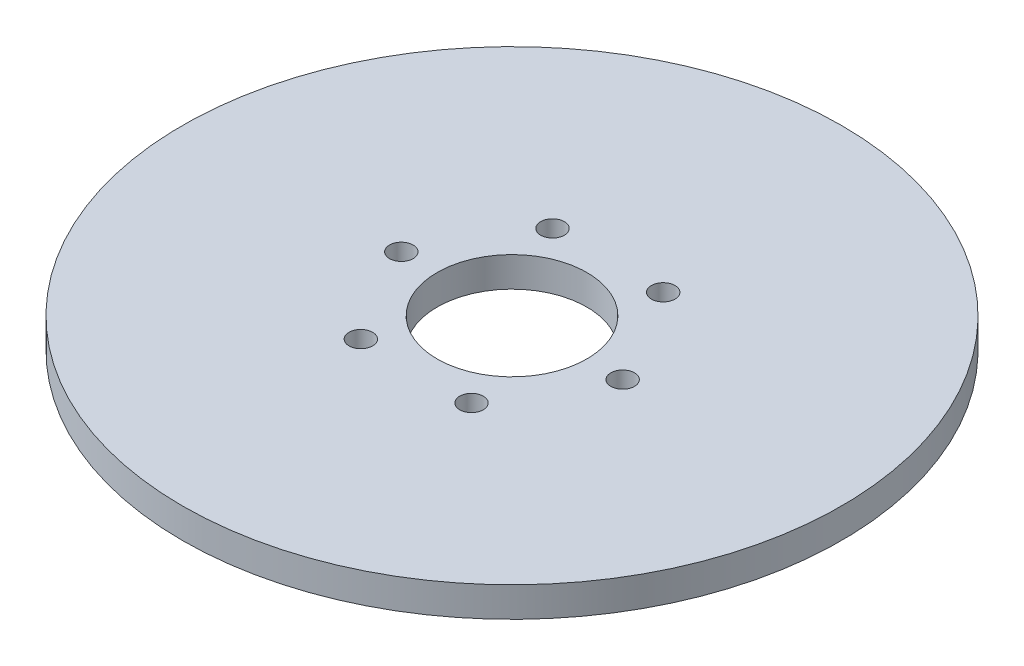
ISO-10303-21;
HEADER;
FILE_DESCRIPTION(('STEP AP214'),'2;1');
FILE_NAME('part.step','',(''),(''),'','','');
FILE_SCHEMA(('AUTOMOTIVE_DESIGN { 1 0 10303 214 1 1 1 1 }'));
ENDSEC;
DATA;
#1=APPLICATION_CONTEXT('core data for automotive mechanical design processes');
#2=APPLICATION_PROTOCOL_DEFINITION('international standard','automotive_design',2000,#1);
#3=PRODUCT_CONTEXT('',#1,'mechanical');
#4=PRODUCT('Part','Part','',(#3));
#5=PRODUCT_RELATED_PRODUCT_CATEGORY('part','',(#4));
#6=PRODUCT_DEFINITION_FORMATION('','',#4);
#7=PRODUCT_DEFINITION_CONTEXT('part definition',#1,'design');
#8=PRODUCT_DEFINITION('design','',#6,#7);
#9=PRODUCT_DEFINITION_SHAPE('','',#8);
#10=(LENGTH_UNIT() NAMED_UNIT(*) SI_UNIT(.MILLI.,.METRE.));
#11=(NAMED_UNIT(*) PLANE_ANGLE_UNIT() SI_UNIT($,.RADIAN.));
#12=(NAMED_UNIT(*) SI_UNIT($,.STERADIAN.) SOLID_ANGLE_UNIT());
#13=UNCERTAINTY_MEASURE_WITH_UNIT(LENGTH_MEASURE(1.E-05),#10,'distance_accuracy_value','');
#14=(GEOMETRIC_REPRESENTATION_CONTEXT(3) GLOBAL_UNCERTAINTY_ASSIGNED_CONTEXT((#13)) GLOBAL_UNIT_ASSIGNED_CONTEXT((#10,
#11,#12)) REPRESENTATION_CONTEXT('',''));
#15=CARTESIAN_POINT('',(0.,0.,0.));
#16=DIRECTION('',(0.,0.,1.));
#17=DIRECTION('',(1.,0.,0.));
#18=AXIS2_PLACEMENT_3D('',#15,#16,#17);
#19=CARTESIAN_POINT('',(0.,5.,0.));
#20=DIRECTION('',(0.,-1.,0.));
#21=DIRECTION('',(0.,0.,-1.));
#22=AXIS2_PLACEMENT_3D('',#19,#20,#21);
#23=CYLINDRICAL_SURFACE('',#22,55.);
#24=CARTESIAN_POINT('',(0.,5.,0.));
#25=DIRECTION('',(0.,1.,0.));
#26=DIRECTION('',(0.,0.,1.));
#27=AXIS2_PLACEMENT_3D('',#24,#25,#26);
#28=CIRCLE('',#27,55.);
#29=CARTESIAN_POINT('',(0.,5.,55.));
#30=VERTEX_POINT('',#29);
#31=EDGE_CURVE('E10',#30,#30,#28,.T.);
#32=ORIENTED_EDGE('',*,*,#31,.F.);
#33=EDGE_LOOP('',(#32));
#34=FACE_BOUND('',#33,.T.);
#35=CARTESIAN_POINT('',(0.,0.,0.));
#36=DIRECTION('',(0.,1.,0.));
#37=DIRECTION('',(0.,0.,1.));
#38=AXIS2_PLACEMENT_3D('',#35,#36,#37);
#39=CIRCLE('',#38,55.);
#40=CARTESIAN_POINT('',(0.,0.,55.));
#41=VERTEX_POINT('',#40);
#42=EDGE_CURVE('E37',#41,#41,#39,.T.);
#43=ORIENTED_EDGE('',*,*,#42,.T.);
#44=EDGE_LOOP('',(#43));
#45=FACE_BOUND('',#44,.T.);
#46=ADVANCED_FACE('F40',(#34,#45),#23,.T.);
#47=CARTESIAN_POINT('',(0.,5.,0.));
#48=DIRECTION('',(0.,1.,0.));
#49=DIRECTION('',(0.,0.,1.));
#50=AXIS2_PLACEMENT_3D('',#47,#48,#49);
#51=PLANE('',#50);
#52=CARTESIAN_POINT('',(-9.23436310623241,5.,-15.9943860755337));
#53=DIRECTION('',(0.,1.,0.));
#54=DIRECTION('',(-0.866025403784433,0.,0.50000000000001));
#55=AXIS2_PLACEMENT_3D('',#52,#53,#54);
#56=CIRCLE('',#55,1.97238586780923);
#57=CARTESIAN_POINT('',(-10.9424993738206,5.,-15.008193141629));
#58=VERTEX_POINT('',#57);
#59=EDGE_CURVE('E70',#58,#58,#56,.T.);
#60=ORIENTED_EDGE('',*,*,#59,.F.);
#61=EDGE_LOOP('',(#60));
#62=FACE_BOUND('',#61,.T.);
#63=CARTESIAN_POINT('',(9.23436310623207,5.,-15.9943860755338));
#64=DIRECTION('',(0.,1.,0.));
#65=DIRECTION('',(-0.866025403784443,0.,-0.499999999999992));
#66=AXIS2_PLACEMENT_3D('',#63,#64,#65);
#67=CIRCLE('',#66,1.97238586780923);
#68=CARTESIAN_POINT('',(7.52622683864386,5.,-16.9805790094384));
#69=VERTEX_POINT('',#68);
#70=EDGE_CURVE('E71',#69,#69,#67,.T.);
#71=ORIENTED_EDGE('',*,*,#70,.F.);
#72=EDGE_LOOP('',(#71));
#73=FACE_BOUND('',#72,.T.);
#74=CARTESIAN_POINT('',(18.4687262124644,5.,0.));
#75=DIRECTION('',(0.,1.,0.));
#76=DIRECTION('',(0.,0.,-1.));
#77=AXIS2_PLACEMENT_3D('',#74,#75,#76);
#78=CIRCLE('',#77,1.97238586780923);
#79=CARTESIAN_POINT('',(18.4687262124644,5.,-1.97238586780923));
#80=VERTEX_POINT('',#79);
#81=EDGE_CURVE('E78',#80,#80,#78,.T.);
#82=ORIENTED_EDGE('',*,*,#81,.F.);
#83=EDGE_LOOP('',(#82));
#84=FACE_BOUND('',#83,.T.);
#85=CARTESIAN_POINT('',(9.2343631062323,5.,15.9943860755337));
#86=DIRECTION('',(0.,1.,0.));
#87=DIRECTION('',(0.866025403784436,0.,-0.500000000000004));
#88=AXIS2_PLACEMENT_3D('',#85,#86,#87);
#89=CIRCLE('',#88,1.97238586780923);
#90=CARTESIAN_POINT('',(10.9424993738205,5.,15.0081931416291));
#91=VERTEX_POINT('',#90);
#92=EDGE_CURVE('E84',#91,#91,#89,.T.);
#93=ORIENTED_EDGE('',*,*,#92,.F.);
#94=EDGE_LOOP('',(#93));
#95=FACE_BOUND('',#94,.T.);
#96=CARTESIAN_POINT('',(-9.23436310623219,5.,15.9943860755338));
#97=DIRECTION('',(0.,1.,0.));
#98=DIRECTION('',(0.86602540378444,0.,0.499999999999998));
#99=AXIS2_PLACEMENT_3D('',#96,#97,#98);
#100=CIRCLE('',#99,1.97238586780923);
#101=CARTESIAN_POINT('',(-7.52622683864398,5.,16.9805790094384));
#102=VERTEX_POINT('',#101);
#103=EDGE_CURVE('E61',#102,#102,#100,.T.);
#104=ORIENTED_EDGE('',*,*,#103,.F.);
#105=EDGE_LOOP('',(#104));
#106=FACE_BOUND('',#105,.T.);
#107=CARTESIAN_POINT('',(-18.4687262124644,5.,0.));
#108=DIRECTION('',(0.,1.,0.));
#109=DIRECTION('',(0.,0.,1.));
#110=AXIS2_PLACEMENT_3D('',#107,#108,#109);
#111=CIRCLE('',#110,1.97238586780923);
#112=CARTESIAN_POINT('',(-18.4687262124644,5.,1.97238586780923));
#113=VERTEX_POINT('',#112);
#114=EDGE_CURVE('E54',#113,#113,#111,.T.);
#115=ORIENTED_EDGE('',*,*,#114,.F.);
#116=EDGE_LOOP('',(#115));
#117=FACE_BOUND('',#116,.T.);
#118=CARTESIAN_POINT('',(0.,5.,0.));
#119=DIRECTION('',(0.,1.,0.));
#120=DIRECTION('',(0.,0.,1.));
#121=AXIS2_PLACEMENT_3D('',#118,#119,#120);
#122=CIRCLE('',#121,12.5);
#123=CARTESIAN_POINT('',(0.,5.,12.5));
#124=VERTEX_POINT('',#123);
#125=EDGE_CURVE('E50',#124,#124,#122,.T.);
#126=ORIENTED_EDGE('',*,*,#125,.F.);
#127=EDGE_LOOP('',(#126));
#128=FACE_BOUND('',#127,.T.);
#129=ORIENTED_EDGE('',*,*,#31,.T.);
#130=EDGE_LOOP('',(#129));
#131=FACE_BOUND('',#130,.T.);
#132=ADVANCED_FACE('F99',(#62,#73,#84,#95,#106,#117,#128,#131),#51,.T.);
#133=CARTESIAN_POINT('',(0.,0.,0.));
#134=DIRECTION('',(0.,1.,0.));
#135=DIRECTION('',(0.,0.,1.));
#136=AXIS2_PLACEMENT_3D('',#133,#134,#135);
#137=PLANE('',#136);
#138=CARTESIAN_POINT('',(0.,0.,0.));
#139=DIRECTION('',(0.,1.,0.));
#140=DIRECTION('',(0.,0.,1.));
#141=AXIS2_PLACEMENT_3D('',#138,#139,#140);
#142=CIRCLE('',#141,12.5);
#143=CARTESIAN_POINT('',(0.,0.,12.5));
#144=VERTEX_POINT('',#143);
#145=EDGE_CURVE('E47',#144,#144,#142,.T.);
#146=ORIENTED_EDGE('',*,*,#145,.T.);
#147=EDGE_LOOP('',(#146));
#148=FACE_BOUND('',#147,.T.);
#149=ORIENTED_EDGE('',*,*,#42,.F.);
#150=EDGE_LOOP('',(#149));
#151=FACE_BOUND('',#150,.T.);
#152=ADVANCED_FACE('F103',(#148,#151),#137,.F.);
#153=CARTESIAN_POINT('',(0.,5.,0.));
#154=DIRECTION('',(0.,-1.,0.));
#155=DIRECTION('',(0.,0.,-1.));
#156=AXIS2_PLACEMENT_3D('',#153,#154,#155);
#157=CYLINDRICAL_SURFACE('',#156,12.5);
#158=ORIENTED_EDGE('',*,*,#125,.T.);
#159=EDGE_LOOP('',(#158));
#160=FACE_BOUND('',#159,.T.);
#161=ORIENTED_EDGE('',*,*,#145,.F.);
#162=EDGE_LOOP('',(#161));
#163=FACE_BOUND('',#162,.T.);
#164=ADVANCED_FACE('F115',(#160,#163),#157,.F.);
#165=CARTESIAN_POINT('',(-18.4687262124644,1.69371454571005,0.));
#166=DIRECTION('',(0.,1.,0.));
#167=DIRECTION('',(0.,0.,1.));
#168=AXIS2_PLACEMENT_3D('',#165,#166,#167);
#169=CYLINDRICAL_SURFACE('',#168,1.97238586780923);
#170=CARTESIAN_POINT('',(-18.4687262124644,1.69371454571005,0.));
#171=DIRECTION('',(0.,1.,0.));
#172=DIRECTION('',(0.,0.,1.));
#173=AXIS2_PLACEMENT_3D('',#170,#171,#172);
#174=CIRCLE('',#173,1.97238586780923);
#175=CARTESIAN_POINT('',(-18.4687262124644,1.69371454571005,1.97238586780923));
#176=VERTEX_POINT('',#175);
#177=EDGE_CURVE('E55',#176,#176,#174,.T.);
#178=ORIENTED_EDGE('',*,*,#177,.F.);
#179=EDGE_LOOP('',(#178));
#180=FACE_BOUND('',#179,.T.);
#181=ORIENTED_EDGE('',*,*,#114,.T.);
#182=EDGE_LOOP('',(#181));
#183=FACE_BOUND('',#182,.T.);
#184=ADVANCED_FACE('F113',(#180,#183),#169,.F.);
#185=CARTESIAN_POINT('',(-18.4687262124644,1.69371454571005,0.));
#186=DIRECTION('',(0.,1.,0.));
#187=DIRECTION('',(0.,0.,1.));
#188=AXIS2_PLACEMENT_3D('',#185,#186,#187);
#189=PLANE('',#188);
#190=ORIENTED_EDGE('',*,*,#177,.T.);
#191=EDGE_LOOP('',(#190));
#192=FACE_BOUND('',#191,.T.);
#193=ADVANCED_FACE('F144',(#192),#189,.T.);
#194=CARTESIAN_POINT('',(-9.23436310623219,1.69371454571005,15.9943860755338));
#195=DIRECTION('',(0.,1.,0.));
#196=DIRECTION('',(0.,0.,1.));
#197=AXIS2_PLACEMENT_3D('',#194,#195,#196);
#198=CYLINDRICAL_SURFACE('',#197,1.97238586780923);
#199=CARTESIAN_POINT('',(-9.23436310623219,1.69371454571005,15.9943860755338));
#200=DIRECTION('',(0.,1.,0.));
#201=DIRECTION('',(0.86602540378444,0.,0.499999999999998));
#202=AXIS2_PLACEMENT_3D('',#199,#200,#201);
#203=CIRCLE('',#202,1.97238586780923);
#204=CARTESIAN_POINT('',(-7.52622683864398,1.69371454571005,16.9805790094384));
#205=VERTEX_POINT('',#204);
#206=EDGE_CURVE('E59',#205,#205,#203,.T.);
#207=ORIENTED_EDGE('',*,*,#206,.F.);
#208=EDGE_LOOP('',(#207));
#209=FACE_BOUND('',#208,.T.);
#210=ORIENTED_EDGE('',*,*,#103,.T.);
#211=EDGE_LOOP('',(#210));
#212=FACE_BOUND('',#211,.T.);
#213=ADVANCED_FACE('F153',(#209,#212),#198,.F.);
#214=CARTESIAN_POINT('',(-9.23436310623219,1.69371454571005,15.9943860755338));
#215=DIRECTION('',(0.,1.,0.));
#216=DIRECTION('',(0.86602540378444,0.,0.499999999999998));
#217=AXIS2_PLACEMENT_3D('',#214,#215,#216);
#218=PLANE('',#217);
#219=ORIENTED_EDGE('',*,*,#206,.T.);
#220=EDGE_LOOP('',(#219));
#221=FACE_BOUND('',#220,.T.);
#222=ADVANCED_FACE('F96',(#221),#218,.T.);
#223=CARTESIAN_POINT('',(9.2343631062323,1.69371454571005,15.9943860755337));
#224=DIRECTION('',(0.,1.,0.));
#225=DIRECTION('',(0.,0.,1.));
#226=AXIS2_PLACEMENT_3D('',#223,#224,#225);
#227=CYLINDRICAL_SURFACE('',#226,1.97238586780923);
#228=CARTESIAN_POINT('',(9.2343631062323,1.69371454571005,15.9943860755337));
#229=DIRECTION('',(0.,1.,0.));
#230=DIRECTION('',(0.866025403784436,0.,-0.500000000000004));
#231=AXIS2_PLACEMENT_3D('',#228,#229,#230);
#232=CIRCLE('',#231,1.97238586780923);
#233=CARTESIAN_POINT('',(10.9424993738205,1.69371454571005,15.0081931416291));
#234=VERTEX_POINT('',#233);
#235=EDGE_CURVE('E63',#234,#234,#232,.T.);
#236=ORIENTED_EDGE('',*,*,#235,.F.);
#237=EDGE_LOOP('',(#236));
#238=FACE_BOUND('',#237,.T.);
#239=ORIENTED_EDGE('',*,*,#92,.T.);
#240=EDGE_LOOP('',(#239));
#241=FACE_BOUND('',#240,.T.);
#242=ADVANCED_FACE('F91',(#238,#241),#227,.F.);
#243=CARTESIAN_POINT('',(9.2343631062323,1.69371454571005,15.9943860755337));
#244=DIRECTION('',(0.,1.,0.));
#245=DIRECTION('',(0.866025403784436,0.,-0.500000000000004));
#246=AXIS2_PLACEMENT_3D('',#243,#244,#245);
#247=PLANE('',#246);
#248=ORIENTED_EDGE('',*,*,#235,.T.);
#249=EDGE_LOOP('',(#248));
#250=FACE_BOUND('',#249,.T.);
#251=ADVANCED_FACE('F93',(#250),#247,.T.);
#252=CARTESIAN_POINT('',(18.4687262124644,1.69371454571005,0.));
#253=DIRECTION('',(0.,1.,0.));
#254=DIRECTION('',(0.,0.,1.));
#255=AXIS2_PLACEMENT_3D('',#252,#253,#254);
#256=CYLINDRICAL_SURFACE('',#255,1.97238586780923);
#257=CARTESIAN_POINT('',(18.4687262124644,1.69371454571005,0.));
#258=DIRECTION('',(0.,1.,0.));
#259=DIRECTION('',(0.,0.,-1.));
#260=AXIS2_PLACEMENT_3D('',#257,#258,#259);
#261=CIRCLE('',#260,1.97238586780923);
#262=CARTESIAN_POINT('',(18.4687262124644,1.69371454571005,-1.97238586780923));
#263=VERTEX_POINT('',#262);
#264=EDGE_CURVE('E85',#263,#263,#261,.T.);
#265=ORIENTED_EDGE('',*,*,#264,.F.);
#266=EDGE_LOOP('',(#265));
#267=FACE_BOUND('',#266,.T.);
#268=ORIENTED_EDGE('',*,*,#81,.T.);
#269=EDGE_LOOP('',(#268));
#270=FACE_BOUND('',#269,.T.);
#271=ADVANCED_FACE('F187',(#267,#270),#256,.F.);
#272=CARTESIAN_POINT('',(18.4687262124644,1.69371454571005,0.));
#273=DIRECTION('',(0.,1.,0.));
#274=DIRECTION('',(0.,0.,-1.));
#275=AXIS2_PLACEMENT_3D('',#272,#273,#274);
#276=PLANE('',#275);
#277=ORIENTED_EDGE('',*,*,#264,.T.);
#278=EDGE_LOOP('',(#277));
#279=FACE_BOUND('',#278,.T.);
#280=ADVANCED_FACE('F198',(#279),#276,.T.);
#281=CARTESIAN_POINT('',(9.23436310623207,1.69371454571005,-15.9943860755338));
#282=DIRECTION('',(0.,1.,0.));
#283=DIRECTION('',(0.,0.,1.));
#284=AXIS2_PLACEMENT_3D('',#281,#282,#283);
#285=CYLINDRICAL_SURFACE('',#284,1.97238586780923);
#286=CARTESIAN_POINT('',(9.23436310623207,1.69371454571005,-15.9943860755338));
#287=DIRECTION('',(0.,1.,0.));
#288=DIRECTION('',(-0.866025403784443,0.,-0.499999999999992));
#289=AXIS2_PLACEMENT_3D('',#286,#287,#288);
#290=CIRCLE('',#289,1.97238586780923);
#291=CARTESIAN_POINT('',(7.52622683864386,1.69371454571005,-16.9805790094384));
#292=VERTEX_POINT('',#291);
#293=EDGE_CURVE('E76',#292,#292,#290,.T.);
#294=ORIENTED_EDGE('',*,*,#293,.F.);
#295=EDGE_LOOP('',(#294));
#296=FACE_BOUND('',#295,.T.);
#297=ORIENTED_EDGE('',*,*,#70,.T.);
#298=EDGE_LOOP('',(#297));
#299=FACE_BOUND('',#298,.T.);
#300=ADVANCED_FACE('F202',(#296,#299),#285,.F.);
#301=CARTESIAN_POINT('',(9.23436310623207,1.69371454571005,-15.9943860755338));
#302=DIRECTION('',(0.,1.,0.));
#303=DIRECTION('',(-0.866025403784443,0.,-0.499999999999992));
#304=AXIS2_PLACEMENT_3D('',#301,#302,#303);
#305=PLANE('',#304);
#306=ORIENTED_EDGE('',*,*,#293,.T.);
#307=EDGE_LOOP('',(#306));
#308=FACE_BOUND('',#307,.T.);
#309=ADVANCED_FACE('F212',(#308),#305,.T.);
#310=CARTESIAN_POINT('',(-9.23436310623241,1.69371454571005,-15.9943860755337));
#311=DIRECTION('',(0.,1.,0.));
#312=DIRECTION('',(0.,0.,1.));
#313=AXIS2_PLACEMENT_3D('',#310,#311,#312);
#314=CYLINDRICAL_SURFACE('',#313,1.97238586780923);
#315=CARTESIAN_POINT('',(-9.23436310623241,1.69371454571005,-15.9943860755337));
#316=DIRECTION('',(0.,1.,0.));
#317=DIRECTION('',(-0.866025403784433,0.,0.50000000000001));
#318=AXIS2_PLACEMENT_3D('',#315,#316,#317);
#319=CIRCLE('',#318,1.97238586780923);
#320=CARTESIAN_POINT('',(-10.9424993738206,1.69371454571005,-15.008193141629));
#321=VERTEX_POINT('',#320);
#322=EDGE_CURVE('E69',#321,#321,#319,.T.);
#323=ORIENTED_EDGE('',*,*,#322,.F.);
#324=EDGE_LOOP('',(#323));
#325=FACE_BOUND('',#324,.T.);
#326=ORIENTED_EDGE('',*,*,#59,.T.);
#327=EDGE_LOOP('',(#326));
#328=FACE_BOUND('',#327,.T.);
#329=ADVANCED_FACE('F224',(#325,#328),#314,.F.);
#330=CARTESIAN_POINT('',(-9.23436310623241,1.69371454571005,-15.9943860755337));
#331=DIRECTION('',(0.,1.,0.));
#332=DIRECTION('',(-0.866025403784433,0.,0.50000000000001));
#333=AXIS2_PLACEMENT_3D('',#330,#331,#332);
#334=PLANE('',#333);
#335=ORIENTED_EDGE('',*,*,#322,.T.);
#336=EDGE_LOOP('',(#335));
#337=FACE_BOUND('',#336,.T.);
#338=ADVANCED_FACE('F235',(#337),#334,.T.);
#339=CLOSED_SHELL('',(#46,#132,#152,#164,#184,#193,#213,#222,#242,#251,#271,#280,#300,#309,#329,#338));
#340=MANIFOLD_SOLID_BREP('B2',#339);
#341=ADVANCED_BREP_SHAPE_REPRESENTATION('',(#18,#340),#14);
#342=SHAPE_DEFINITION_REPRESENTATION(#9,#341);
ENDSEC;
END-ISO-10303-21;
